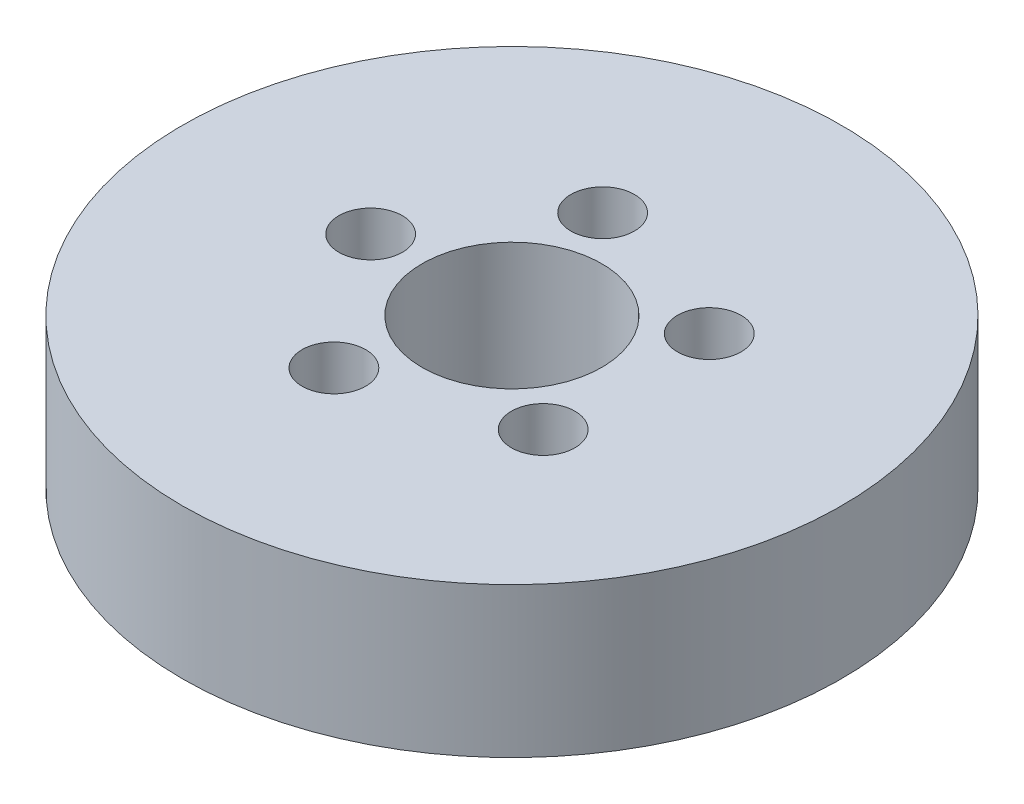
ISO-10303-21;
HEADER;
FILE_DESCRIPTION(('STEP AP214'),'2;1');
FILE_NAME('part.step','',(''),(''),'','','');
FILE_SCHEMA(('AUTOMOTIVE_DESIGN { 1 0 10303 214 1 1 1 1 }'));
ENDSEC;
DATA;
#1=APPLICATION_CONTEXT('core data for automotive mechanical design processes');
#2=APPLICATION_PROTOCOL_DEFINITION('international standard','automotive_design',2000,#1);
#3=PRODUCT_CONTEXT('',#1,'mechanical');
#4=PRODUCT('Part','Part','',(#3));
#5=PRODUCT_RELATED_PRODUCT_CATEGORY('part','',(#4));
#6=PRODUCT_DEFINITION_FORMATION('','',#4);
#7=PRODUCT_DEFINITION_CONTEXT('part definition',#1,'design');
#8=PRODUCT_DEFINITION('design','',#6,#7);
#9=PRODUCT_DEFINITION_SHAPE('','',#8);
#10=(LENGTH_UNIT() NAMED_UNIT(*) SI_UNIT(.MILLI.,.METRE.));
#11=(NAMED_UNIT(*) PLANE_ANGLE_UNIT() SI_UNIT($,.RADIAN.));
#12=(NAMED_UNIT(*) SI_UNIT($,.STERADIAN.) SOLID_ANGLE_UNIT());
#13=UNCERTAINTY_MEASURE_WITH_UNIT(LENGTH_MEASURE(1.E-05),#10,'distance_accuracy_value','');
#14=(GEOMETRIC_REPRESENTATION_CONTEXT(3) GLOBAL_UNCERTAINTY_ASSIGNED_CONTEXT((#13)) GLOBAL_UNIT_ASSIGNED_CONTEXT((#10,
#11,#12)) REPRESENTATION_CONTEXT('',''));
#15=CARTESIAN_POINT('',(0.,0.,0.));
#16=DIRECTION('',(0.,0.,1.));
#17=DIRECTION('',(1.,0.,0.));
#18=AXIS2_PLACEMENT_3D('',#15,#16,#17);
#19=CARTESIAN_POINT('',(0.,25.,0.));
#20=DIRECTION('',(0.,-1.,0.));
#21=DIRECTION('',(0.,0.,-1.));
#22=AXIS2_PLACEMENT_3D('',#19,#20,#21);
#23=CYLINDRICAL_SURFACE('',#22,55.);
#24=CARTESIAN_POINT('',(0.,25.,0.));
#25=DIRECTION('',(0.,1.,0.));
#26=DIRECTION('',(0.,0.,1.));
#27=AXIS2_PLACEMENT_3D('',#24,#25,#26);
#28=CIRCLE('',#27,55.);
#29=CARTESIAN_POINT('',(0.,25.,55.));
#30=VERTEX_POINT('',#29);
#31=EDGE_CURVE('E10',#30,#30,#28,.T.);
#32=ORIENTED_EDGE('',*,*,#31,.F.);
#33=EDGE_LOOP('',(#32));
#34=FACE_BOUND('',#33,.T.);
#35=CARTESIAN_POINT('',(0.,0.,0.));
#36=DIRECTION('',(0.,1.,0.));
#37=DIRECTION('',(0.,0.,1.));
#38=AXIS2_PLACEMENT_3D('',#35,#36,#37);
#39=CIRCLE('',#38,55.);
#40=CARTESIAN_POINT('',(0.,0.,55.));
#41=VERTEX_POINT('',#40);
#42=EDGE_CURVE('E37',#41,#41,#39,.T.);
#43=ORIENTED_EDGE('',*,*,#42,.T.);
#44=EDGE_LOOP('',(#43));
#45=FACE_BOUND('',#44,.T.);
#46=ADVANCED_FACE('F40',(#34,#45),#23,.T.);
#47=CARTESIAN_POINT('',(0.,25.,0.));
#48=DIRECTION('',(0.,1.,0.));
#49=DIRECTION('',(0.,0.,1.));
#50=AXIS2_PLACEMENT_3D('',#47,#48,#49);
#51=PLANE('',#50);
#52=CARTESIAN_POINT('',(-7.28649149152444,25.,-22.4255149072315));
#53=DIRECTION('',(0.,1.,0.));
#54=DIRECTION('',(-0.95105651629515,0.,0.309016994374958));
#55=AXIS2_PLACEMENT_3D('',#52,#53,#54);
#56=CIRCLE('',#55,5.30313615925946);
#57=CARTESIAN_POINT('',(-12.3300736925886,25.,-20.7867557105359));
#58=VERTEX_POINT('',#57);
#59=EDGE_CURVE('E70',#58,#58,#56,.T.);
#60=ORIENTED_EDGE('',*,*,#59,.F.);
#61=EDGE_LOOP('',(#60));
#62=FACE_BOUND('',#61,.T.);
#63=CARTESIAN_POINT('',(19.0762823835471,25.,-13.8597304278867));
#64=DIRECTION('',(0.,1.,0.));
#65=DIRECTION('',(-0.58778525229248,0.,-0.809016994374942));
#66=AXIS2_PLACEMENT_3D('',#63,#64,#65);
#67=CIRCLE('',#66,5.30313615925946);
#68=CARTESIAN_POINT('',(15.9591771582354,25.,-18.1500577042119));
#69=VERTEX_POINT('',#68);
#70=EDGE_CURVE('E71',#69,#69,#67,.T.);
#71=ORIENTED_EDGE('',*,*,#70,.F.);
#72=EDGE_LOOP('',(#71));
#73=FACE_BOUND('',#72,.T.);
#74=CARTESIAN_POINT('',(19.0762823835473,25.,13.8597304278864));
#75=DIRECTION('',(0.,1.,0.));
#76=DIRECTION('',(0.587785252292469,0.,-0.809016994374951));
#77=AXIS2_PLACEMENT_3D('',#74,#75,#76);
#78=CIRCLE('',#77,5.30313615925946);
#79=CARTESIAN_POINT('',(22.193387608859,25.,9.56940315156123));
#80=VERTEX_POINT('',#79);
#81=EDGE_CURVE('E78',#80,#80,#78,.T.);
#82=ORIENTED_EDGE('',*,*,#81,.F.);
#83=EDGE_LOOP('',(#82));
#84=FACE_BOUND('',#83,.T.);
#85=CARTESIAN_POINT('',(-7.28649149152413,25.,22.4255149072316));
#86=DIRECTION('',(0.,1.,0.));
#87=DIRECTION('',(0.951056516295155,0.,0.309016994374945));
#88=AXIS2_PLACEMENT_3D('',#85,#86,#87);
#89=CIRCLE('',#88,5.30313615925946);
#90=CARTESIAN_POINT('',(-2.24290929045996,25.,24.064274103927));
#91=VERTEX_POINT('',#90);
#92=EDGE_CURVE('E61',#91,#91,#89,.T.);
#93=ORIENTED_EDGE('',*,*,#92,.F.);
#94=EDGE_LOOP('',(#93));
#95=FACE_BOUND('',#94,.T.);
#96=CARTESIAN_POINT('',(-23.5795817840461,25.,0.));
#97=DIRECTION('',(0.,1.,0.));
#98=DIRECTION('',(0.,0.,1.));
#99=AXIS2_PLACEMENT_3D('',#96,#97,#98);
#100=CIRCLE('',#99,5.30313615925946);
#101=CARTESIAN_POINT('',(-23.5795817840461,25.,5.30313615925946));
#102=VERTEX_POINT('',#101);
#103=EDGE_CURVE('E54',#102,#102,#100,.T.);
#104=ORIENTED_EDGE('',*,*,#103,.F.);
#105=EDGE_LOOP('',(#104));
#106=FACE_BOUND('',#105,.T.);
#107=CARTESIAN_POINT('',(0.,25.,0.));
#108=DIRECTION('',(0.,1.,0.));
#109=DIRECTION('',(0.,0.,1.));
#110=AXIS2_PLACEMENT_3D('',#107,#108,#109);
#111=CIRCLE('',#110,15.);
#112=CARTESIAN_POINT('',(0.,25.,15.));
#113=VERTEX_POINT('',#112);
#114=EDGE_CURVE('E50',#113,#113,#111,.T.);
#115=ORIENTED_EDGE('',*,*,#114,.F.);
#116=EDGE_LOOP('',(#115));
#117=FACE_BOUND('',#116,.T.);
#118=ORIENTED_EDGE('',*,*,#31,.T.);
#119=EDGE_LOOP('',(#118));
#120=FACE_BOUND('',#119,.T.);
#121=ADVANCED_FACE('F94',(#62,#73,#84,#95,#106,#117,#120),#51,.T.);
#122=CARTESIAN_POINT('',(0.,0.,0.));
#123=DIRECTION('',(0.,1.,0.));
#124=DIRECTION('',(0.,0.,1.));
#125=AXIS2_PLACEMENT_3D('',#122,#123,#124);
#126=PLANE('',#125);
#127=CARTESIAN_POINT('',(0.,0.,0.));
#128=DIRECTION('',(0.,1.,0.));
#129=DIRECTION('',(0.,0.,1.));
#130=AXIS2_PLACEMENT_3D('',#127,#128,#129);
#131=CIRCLE('',#130,15.);
#132=CARTESIAN_POINT('',(0.,0.,15.));
#133=VERTEX_POINT('',#132);
#134=EDGE_CURVE('E47',#133,#133,#131,.T.);
#135=ORIENTED_EDGE('',*,*,#134,.T.);
#136=EDGE_LOOP('',(#135));
#137=FACE_BOUND('',#136,.T.);
#138=ORIENTED_EDGE('',*,*,#42,.F.);
#139=EDGE_LOOP('',(#138));
#140=FACE_BOUND('',#139,.T.);
#141=ADVANCED_FACE('F100',(#137,#140),#126,.F.);
#142=CARTESIAN_POINT('',(0.,25.,0.));
#143=DIRECTION('',(0.,-1.,0.));
#144=DIRECTION('',(0.,0.,-1.));
#145=AXIS2_PLACEMENT_3D('',#142,#143,#144);
#146=CYLINDRICAL_SURFACE('',#145,15.);
#147=ORIENTED_EDGE('',*,*,#114,.T.);
#148=EDGE_LOOP('',(#147));
#149=FACE_BOUND('',#148,.T.);
#150=ORIENTED_EDGE('',*,*,#134,.F.);
#151=EDGE_LOOP('',(#150));
#152=FACE_BOUND('',#151,.T.);
#153=ADVANCED_FACE('F106',(#149,#152),#146,.F.);
#154=CARTESIAN_POINT('',(-23.5795817840461,6.98074085286861,0.));
#155=DIRECTION('',(0.,1.,0.));
#156=DIRECTION('',(0.,0.,1.));
#157=AXIS2_PLACEMENT_3D('',#154,#155,#156);
#158=CYLINDRICAL_SURFACE('',#157,5.30313615925946);
#159=CARTESIAN_POINT('',(-23.5795817840461,6.98074085286861,0.));
#160=DIRECTION('',(0.,1.,0.));
#161=DIRECTION('',(0.,0.,1.));
#162=AXIS2_PLACEMENT_3D('',#159,#160,#161);
#163=CIRCLE('',#162,5.30313615925946);
#164=CARTESIAN_POINT('',(-23.5795817840461,6.98074085286861,5.30313615925946));
#165=VERTEX_POINT('',#164);
#166=EDGE_CURVE('E55',#165,#165,#163,.T.);
#167=ORIENTED_EDGE('',*,*,#166,.F.);
#168=EDGE_LOOP('',(#167));
#169=FACE_BOUND('',#168,.T.);
#170=ORIENTED_EDGE('',*,*,#103,.T.);
#171=EDGE_LOOP('',(#170));
#172=FACE_BOUND('',#171,.T.);
#173=ADVANCED_FACE('F108',(#169,#172),#158,.F.);
#174=CARTESIAN_POINT('',(-23.5795817840461,6.98074085286861,0.));
#175=DIRECTION('',(0.,1.,0.));
#176=DIRECTION('',(0.,0.,1.));
#177=AXIS2_PLACEMENT_3D('',#174,#175,#176);
#178=PLANE('',#177);
#179=ORIENTED_EDGE('',*,*,#166,.T.);
#180=EDGE_LOOP('',(#179));
#181=FACE_BOUND('',#180,.T.);
#182=ADVANCED_FACE('F138',(#181),#178,.T.);
#183=CARTESIAN_POINT('',(-7.28649149152413,6.98074085286861,22.4255149072316));
#184=DIRECTION('',(0.,1.,0.));
#185=DIRECTION('',(0.,0.,1.));
#186=AXIS2_PLACEMENT_3D('',#183,#184,#185);
#187=CYLINDRICAL_SURFACE('',#186,5.30313615925946);
#188=CARTESIAN_POINT('',(-7.28649149152413,6.98074085286861,22.4255149072316));
#189=DIRECTION('',(0.,1.,0.));
#190=DIRECTION('',(0.951056516295155,0.,0.309016994374945));
#191=AXIS2_PLACEMENT_3D('',#188,#189,#190);
#192=CIRCLE('',#191,5.30313615925946);
#193=CARTESIAN_POINT('',(-2.24290929045996,6.98074085286861,24.064274103927));
#194=VERTEX_POINT('',#193);
#195=EDGE_CURVE('E59',#194,#194,#192,.T.);
#196=ORIENTED_EDGE('',*,*,#195,.F.);
#197=EDGE_LOOP('',(#196));
#198=FACE_BOUND('',#197,.T.);
#199=ORIENTED_EDGE('',*,*,#92,.T.);
#200=EDGE_LOOP('',(#199));
#201=FACE_BOUND('',#200,.T.);
#202=ADVANCED_FACE('F150',(#198,#201),#187,.F.);
#203=CARTESIAN_POINT('',(-7.28649149152413,6.98074085286861,22.4255149072316));
#204=DIRECTION('',(0.,1.,0.));
#205=DIRECTION('',(0.951056516295155,0.,0.309016994374945));
#206=AXIS2_PLACEMENT_3D('',#203,#204,#205);
#207=PLANE('',#206);
#208=ORIENTED_EDGE('',*,*,#195,.T.);
#209=EDGE_LOOP('',(#208));
#210=FACE_BOUND('',#209,.T.);
#211=ADVANCED_FACE('F89',(#210),#207,.T.);
#212=CARTESIAN_POINT('',(19.0762823835473,6.98074085286861,13.8597304278864));
#213=DIRECTION('',(0.,1.,0.));
#214=DIRECTION('',(0.,0.,1.));
#215=AXIS2_PLACEMENT_3D('',#212,#213,#214);
#216=CYLINDRICAL_SURFACE('',#215,5.30313615925946);
#217=CARTESIAN_POINT('',(19.0762823835473,6.98074085286861,13.8597304278864));
#218=DIRECTION('',(0.,1.,0.));
#219=DIRECTION('',(0.587785252292469,0.,-0.809016994374951));
#220=AXIS2_PLACEMENT_3D('',#217,#218,#219);
#221=CIRCLE('',#220,5.30313615925946);
#222=CARTESIAN_POINT('',(22.193387608859,6.98074085286861,9.56940315156123));
#223=VERTEX_POINT('',#222);
#224=EDGE_CURVE('E63',#223,#223,#221,.T.);
#225=ORIENTED_EDGE('',*,*,#224,.F.);
#226=EDGE_LOOP('',(#225));
#227=FACE_BOUND('',#226,.T.);
#228=ORIENTED_EDGE('',*,*,#81,.T.);
#229=EDGE_LOOP('',(#228));
#230=FACE_BOUND('',#229,.T.);
#231=ADVANCED_FACE('F87',(#227,#230),#216,.F.);
#232=CARTESIAN_POINT('',(19.0762823835473,6.98074085286861,13.8597304278864));
#233=DIRECTION('',(0.,1.,0.));
#234=DIRECTION('',(0.587785252292469,0.,-0.809016994374951));
#235=AXIS2_PLACEMENT_3D('',#232,#233,#234);
#236=PLANE('',#235);
#237=ORIENTED_EDGE('',*,*,#224,.T.);
#238=EDGE_LOOP('',(#237));
#239=FACE_BOUND('',#238,.T.);
#240=ADVANCED_FACE('F84',(#239),#236,.T.);
#241=CARTESIAN_POINT('',(19.0762823835471,6.98074085286861,-13.8597304278867));
#242=DIRECTION('',(0.,1.,0.));
#243=DIRECTION('',(0.,0.,1.));
#244=AXIS2_PLACEMENT_3D('',#241,#242,#243);
#245=CYLINDRICAL_SURFACE('',#244,5.30313615925946);
#246=CARTESIAN_POINT('',(19.0762823835471,6.98074085286861,-13.8597304278867));
#247=DIRECTION('',(0.,1.,0.));
#248=DIRECTION('',(-0.58778525229248,0.,-0.809016994374942));
#249=AXIS2_PLACEMENT_3D('',#246,#247,#248);
#250=CIRCLE('',#249,5.30313615925946);
#251=CARTESIAN_POINT('',(15.9591771582354,6.98074085286861,-18.1500577042119));
#252=VERTEX_POINT('',#251);
#253=EDGE_CURVE('E76',#252,#252,#250,.T.);
#254=ORIENTED_EDGE('',*,*,#253,.F.);
#255=EDGE_LOOP('',(#254));
#256=FACE_BOUND('',#255,.T.);
#257=ORIENTED_EDGE('',*,*,#70,.T.);
#258=EDGE_LOOP('',(#257));
#259=FACE_BOUND('',#258,.T.);
#260=ADVANCED_FACE('F185',(#256,#259),#245,.F.);
#261=CARTESIAN_POINT('',(19.0762823835471,6.98074085286861,-13.8597304278867));
#262=DIRECTION('',(0.,1.,0.));
#263=DIRECTION('',(-0.58778525229248,0.,-0.809016994374942));
#264=AXIS2_PLACEMENT_3D('',#261,#262,#263);
#265=PLANE('',#264);
#266=ORIENTED_EDGE('',*,*,#253,.T.);
#267=EDGE_LOOP('',(#266));
#268=FACE_BOUND('',#267,.T.);
#269=ADVANCED_FACE('F189',(#268),#265,.T.);
#270=CARTESIAN_POINT('',(-7.28649149152444,6.98074085286861,-22.4255149072315));
#271=DIRECTION('',(0.,1.,0.));
#272=DIRECTION('',(0.,0.,1.));
#273=AXIS2_PLACEMENT_3D('',#270,#271,#272);
#274=CYLINDRICAL_SURFACE('',#273,5.30313615925946);
#275=CARTESIAN_POINT('',(-7.28649149152444,6.98074085286861,-22.4255149072315));
#276=DIRECTION('',(0.,1.,0.));
#277=DIRECTION('',(-0.95105651629515,0.,0.309016994374958));
#278=AXIS2_PLACEMENT_3D('',#275,#276,#277);
#279=CIRCLE('',#278,5.30313615925946);
#280=CARTESIAN_POINT('',(-12.3300736925886,6.98074085286861,-20.7867557105359));
#281=VERTEX_POINT('',#280);
#282=EDGE_CURVE('E69',#281,#281,#279,.T.);
#283=ORIENTED_EDGE('',*,*,#282,.F.);
#284=EDGE_LOOP('',(#283));
#285=FACE_BOUND('',#284,.T.);
#286=ORIENTED_EDGE('',*,*,#59,.T.);
#287=EDGE_LOOP('',(#286));
#288=FACE_BOUND('',#287,.T.);
#289=ADVANCED_FACE('F200',(#285,#288),#274,.F.);
#290=CARTESIAN_POINT('',(-7.28649149152444,6.98074085286861,-22.4255149072315));
#291=DIRECTION('',(0.,1.,0.));
#292=DIRECTION('',(-0.95105651629515,0.,0.309016994374958));
#293=AXIS2_PLACEMENT_3D('',#290,#291,#292);
#294=PLANE('',#293);
#295=ORIENTED_EDGE('',*,*,#282,.T.);
#296=EDGE_LOOP('',(#295));
#297=FACE_BOUND('',#296,.T.);
#298=ADVANCED_FACE('F208',(#297),#294,.T.);
#299=CLOSED_SHELL('',(#46,#121,#141,#153,#173,#182,#202,#211,#231,#240,#260,#269,#289,#298));
#300=MANIFOLD_SOLID_BREP('B2',#299);
#301=ADVANCED_BREP_SHAPE_REPRESENTATION('',(#18,#300),#14);
#302=SHAPE_DEFINITION_REPRESENTATION(#9,#301);
ENDSEC;
END-ISO-10303-21;
